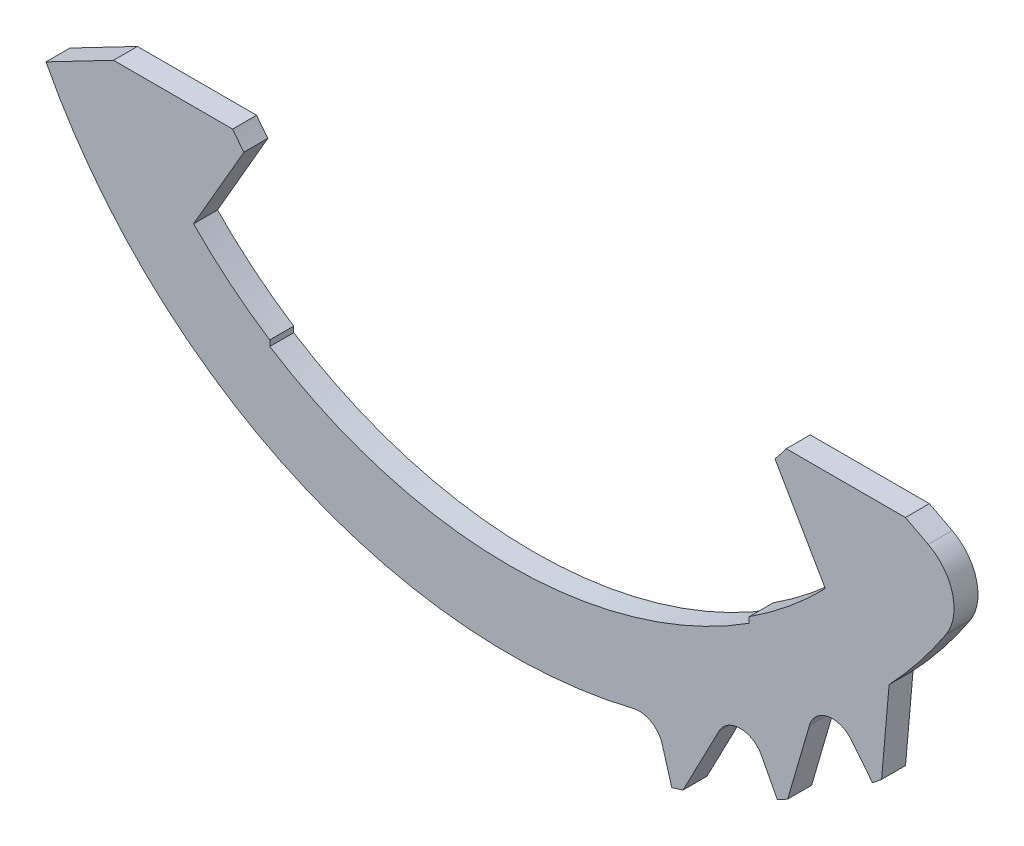
ISO-10303-21;
HEADER;
FILE_DESCRIPTION(('STEP AP214'),'2;1');
FILE_NAME('part.step','',(''),(''),'','','');
FILE_SCHEMA(('AUTOMOTIVE_DESIGN { 1 0 10303 214 1 1 1 1 }'));
ENDSEC;
DATA;
#1=APPLICATION_CONTEXT('core data for automotive mechanical design processes');
#2=APPLICATION_PROTOCOL_DEFINITION('international standard','automotive_design',2000,#1);
#3=PRODUCT_CONTEXT('',#1,'mechanical');
#4=PRODUCT('Part','Part','',(#3));
#5=PRODUCT_RELATED_PRODUCT_CATEGORY('part','',(#4));
#6=PRODUCT_DEFINITION_FORMATION('','',#4);
#7=PRODUCT_DEFINITION_CONTEXT('part definition',#1,'design');
#8=PRODUCT_DEFINITION('design','',#6,#7);
#9=PRODUCT_DEFINITION_SHAPE('','',#8);
#10=(LENGTH_UNIT() NAMED_UNIT(*) SI_UNIT(.MILLI.,.METRE.));
#11=(NAMED_UNIT(*) PLANE_ANGLE_UNIT() SI_UNIT($,.RADIAN.));
#12=(NAMED_UNIT(*) SI_UNIT($,.STERADIAN.) SOLID_ANGLE_UNIT());
#13=UNCERTAINTY_MEASURE_WITH_UNIT(LENGTH_MEASURE(1.E-05),#10,'distance_accuracy_value','');
#14=(GEOMETRIC_REPRESENTATION_CONTEXT(3) GLOBAL_UNCERTAINTY_ASSIGNED_CONTEXT((#13)) GLOBAL_UNIT_ASSIGNED_CONTEXT((#10,
#11,#12)) REPRESENTATION_CONTEXT('',''));
#15=CARTESIAN_POINT('',(0.,0.,0.));
#16=DIRECTION('',(0.,0.,1.));
#17=DIRECTION('',(1.,0.,0.));
#18=AXIS2_PLACEMENT_3D('',#15,#16,#17);
#19=CARTESIAN_POINT('',(2.70695605514835,-11.0739509171522,-0.00100000000000002));
#20=DIRECTION('',(0.,0.,1.));
#21=DIRECTION('',(1.,0.,0.));
#22=AXIS2_PLACEMENT_3D('',#19,#20,#21);
#23=CYLINDRICAL_SURFACE('',#22,0.5);
#24=DIRECTION('',(0.,0.,1.));
#25=VECTOR('',#24,1.);
#26=CARTESIAN_POINT('',(2.58822991237867,-10.5882513155227,-0.00100000000000002));
#27=LINE('',#26,#25);
#28=CARTESIAN_POINT('',(2.58822991237867,-10.5882513155227,0.));
#29=VERTEX_POINT('',#28);
#30=CARTESIAN_POINT('',(2.58822991237867,-10.5882513155227,0.5));
#31=VERTEX_POINT('',#30);
#32=EDGE_CURVE('E239',#29,#31,#27,.T.);
#33=ORIENTED_EDGE('',*,*,#32,.F.);
#34=CARTESIAN_POINT('',(2.70695605514835,-11.0739509171522,0.));
#35=DIRECTION('',(0.,0.,-1.));
#36=DIRECTION('',(-1.,0.,0.));
#37=AXIS2_PLACEMENT_3D('',#34,#35,#36);
#38=CIRCLE('',#37,0.5);
#39=CARTESIAN_POINT('',(3.18698098234131,-10.9340364101367,0.));
#40=VERTEX_POINT('',#39);
#41=EDGE_CURVE('E418',#40,#29,#38,.F.);
#42=ORIENTED_EDGE('',*,*,#41,.F.);
#43=DIRECTION('',(0.,0.,1.));
#44=VECTOR('',#43,1.);
#45=CARTESIAN_POINT('',(3.18698098234131,-10.9340364101367,-0.00100000000000002));
#46=LINE('',#45,#44);
#47=CARTESIAN_POINT('',(3.18698098234131,-10.9340364101367,0.5));
#48=VERTEX_POINT('',#47);
#49=EDGE_CURVE('E427',#40,#48,#46,.T.);
#50=ORIENTED_EDGE('',*,*,#49,.T.);
#51=CARTESIAN_POINT('',(2.70695605514835,-11.0739509171522,0.5));
#52=DIRECTION('',(0.,0.,1.));
#53=DIRECTION('',(0.382683432365087,0.923879532511288,0.));
#54=AXIS2_PLACEMENT_3D('',#51,#52,#53);
#55=CIRCLE('',#54,0.5);
#56=EDGE_CURVE('E424',#48,#31,#55,.T.);
#57=ORIENTED_EDGE('',*,*,#56,.T.);
#58=EDGE_LOOP('',(#33,#42,#50,#57));
#59=FACE_BOUND('',#58,.T.);
#60=ADVANCED_FACE('F50',(#59),#23,.F.);
#61=CARTESIAN_POINT('',(0.,0.,0.5));
#62=DIRECTION('',(0.,0.,-1.));
#63=DIRECTION('',(-1.,0.,0.));
#64=AXIS2_PLACEMENT_3D('',#61,#62,#63);
#65=CYLINDRICAL_SURFACE('',#64,12.1);
#66=CARTESIAN_POINT('',(0.,0.,0.));
#67=DIRECTION('',(0.,0.,1.));
#68=DIRECTION('',(1.,0.,0.));
#69=AXIS2_PLACEMENT_3D('',#66,#67,#68);
#70=CIRCLE('',#69,12.1);
#71=CARTESIAN_POINT('',(7.57367401342711,-9.43660224542387,0.));
#72=VERTEX_POINT('',#71);
#73=CARTESIAN_POINT('',(7.76317902804415,-9.28132810423893,0.));
#74=VERTEX_POINT('',#73);
#75=EDGE_CURVE('E295',#72,#74,#70,.T.);
#76=ORIENTED_EDGE('',*,*,#75,.T.);
#77=DIRECTION('',(0.,0.,1.));
#78=VECTOR('',#77,1.);
#79=CARTESIAN_POINT('',(7.76317902804415,-9.28132810423893,-0.00100000000000002));
#80=LINE('',#79,#78);
#81=CARTESIAN_POINT('',(7.76317902804415,-9.28132810423893,0.5));
#82=VERTEX_POINT('',#81);
#83=EDGE_CURVE('E363',#74,#82,#80,.T.);
#84=ORIENTED_EDGE('',*,*,#83,.T.);
#85=CARTESIAN_POINT('',(0.,0.,0.5));
#86=DIRECTION('',(0.,0.,1.));
#87=DIRECTION('',(1.,0.,0.));
#88=AXIS2_PLACEMENT_3D('',#85,#86,#87);
#89=CIRCLE('',#88,12.1);
#90=CARTESIAN_POINT('',(7.57367401342711,-9.43660224542387,0.5));
#91=VERTEX_POINT('',#90);
#92=EDGE_CURVE('E257',#91,#82,#89,.T.);
#93=ORIENTED_EDGE('',*,*,#92,.F.);
#94=DIRECTION('',(0.,0.,1.));
#95=VECTOR('',#94,1.);
#96=CARTESIAN_POINT('',(7.57367401342711,-9.43660224542387,-0.00100000000000002));
#97=LINE('',#96,#95);
#98=EDGE_CURVE('E380',#72,#91,#97,.T.);
#99=ORIENTED_EDGE('',*,*,#98,.F.);
#100=EDGE_LOOP('',(#76,#84,#93,#99));
#101=FACE_BOUND('',#100,.T.);
#102=ADVANCED_FACE('F468',(#101),#65,.T.);
#103=CARTESIAN_POINT('',(5.5871582201439,-10.7328310814565,0.));
#104=VERTEX_POINT('',#103);
#105=CARTESIAN_POINT('',(5.80331443124744,-10.6175110836804,0.));
#106=VERTEX_POINT('',#105);
#107=EDGE_CURVE('E298',#104,#106,#70,.T.);
#108=ORIENTED_EDGE('',*,*,#107,.T.);
#109=DIRECTION('',(0.,0.,1.));
#110=VECTOR('',#109,1.);
#111=CARTESIAN_POINT('',(5.80331443124744,-10.6175110836804,-0.00100000000000002));
#112=LINE('',#111,#110);
#113=CARTESIAN_POINT('',(5.80331443124744,-10.6175110836804,0.5));
#114=VERTEX_POINT('',#113);
#115=EDGE_CURVE('E381',#106,#114,#112,.T.);
#116=ORIENTED_EDGE('',*,*,#115,.T.);
#117=CARTESIAN_POINT('',(5.5871582201439,-10.7328310814565,0.5));
#118=VERTEX_POINT('',#117);
#119=EDGE_CURVE('E260',#118,#114,#89,.T.);
#120=ORIENTED_EDGE('',*,*,#119,.F.);
#121=DIRECTION('',(0.,0.,1.));
#122=VECTOR('',#121,1.);
#123=CARTESIAN_POINT('',(5.5871582201439,-10.7328310814565,-0.00100000000000002));
#124=LINE('',#123,#122);
#125=EDGE_CURVE('E406',#104,#118,#124,.T.);
#126=ORIENTED_EDGE('',*,*,#125,.F.);
#127=EDGE_LOOP('',(#108,#116,#120,#126));
#128=FACE_BOUND('',#127,.T.);
#129=ADVANCED_FACE('F485',(#128),#65,.T.);
#130=CARTESIAN_POINT('',(3.38593106977499,-11.6166032380697,0.));
#131=VERTEX_POINT('',#130);
#132=CARTESIAN_POINT('',(3.62043171539412,-11.5456690665448,0.));
#133=VERTEX_POINT('',#132);
#134=EDGE_CURVE('E299',#131,#133,#70,.T.);
#135=ORIENTED_EDGE('',*,*,#134,.T.);
#136=DIRECTION('',(0.,0.,1.));
#137=VECTOR('',#136,1.);
#138=CARTESIAN_POINT('',(3.62043171539412,-11.5456690665448,-0.00100000000000002));
#139=LINE('',#138,#137);
#140=CARTESIAN_POINT('',(3.62043171539412,-11.5456690665448,0.5));
#141=VERTEX_POINT('',#140);
#142=EDGE_CURVE('E407',#133,#141,#139,.T.);
#143=ORIENTED_EDGE('',*,*,#142,.T.);
#144=CARTESIAN_POINT('',(3.38593106977499,-11.6166032380697,0.5));
#145=VERTEX_POINT('',#144);
#146=EDGE_CURVE('E262',#145,#141,#89,.T.);
#147=ORIENTED_EDGE('',*,*,#146,.F.);
#148=DIRECTION('',(0.,0.,1.));
#149=VECTOR('',#148,1.);
#150=CARTESIAN_POINT('',(3.38593106977499,-11.6166032380697,-0.00100000000000002));
#151=LINE('',#150,#149);
#152=EDGE_CURVE('E426',#131,#145,#151,.T.);
#153=ORIENTED_EDGE('',*,*,#152,.F.);
#154=EDGE_LOOP('',(#135,#143,#147,#153));
#155=FACE_BOUND('',#154,.T.);
#156=ADVANCED_FACE('F491',(#155),#65,.T.);
#157=CARTESIAN_POINT('',(0.,0.,0.5));
#158=DIRECTION('',(0.,0.,-1.));
#159=DIRECTION('',(-1.,0.,0.));
#160=AXIS2_PLACEMENT_3D('',#157,#158,#159);
#161=CYLINDRICAL_SURFACE('',#160,7.2);
#162=CARTESIAN_POINT('',(0.,0.,0.));
#163=DIRECTION('',(0.,0.,-1.));
#164=DIRECTION('',(-1.,0.,0.));
#165=AXIS2_PLACEMENT_3D('',#162,#163,#164);
#166=CIRCLE('',#165,7.2);
#167=CARTESIAN_POINT('',(5.77494588719236,-4.3,0.));
#168=VERTEX_POINT('',#167);
#169=CARTESIAN_POINT('',(5.53923133011576,-4.5996647999027,0.));
#170=VERTEX_POINT('',#169);
#171=EDGE_CURVE('E272',#168,#170,#166,.T.);
#172=ORIENTED_EDGE('',*,*,#171,.T.);
#173=DIRECTION('',(0.,0.,-1.));
#174=VECTOR('',#173,1.);
#175=CARTESIAN_POINT('',(5.53923133011576,-4.5996647999027,0.5));
#176=LINE('',#175,#174);
#177=CARTESIAN_POINT('',(5.53923133011576,-4.5996647999027,0.5));
#178=VERTEX_POINT('',#177);
#179=EDGE_CURVE('E336',#178,#170,#176,.T.);
#180=ORIENTED_EDGE('',*,*,#179,.F.);
#181=CARTESIAN_POINT('',(0.,0.,0.5));
#182=DIRECTION('',(0.,0.,-1.));
#183=DIRECTION('',(-1.,0.,0.));
#184=AXIS2_PLACEMENT_3D('',#181,#182,#183);
#185=CIRCLE('',#184,7.2);
#186=CARTESIAN_POINT('',(5.77494588719236,-4.3,0.5));
#187=VERTEX_POINT('',#186);
#188=EDGE_CURVE('E304',#187,#178,#185,.T.);
#189=ORIENTED_EDGE('',*,*,#188,.F.);
#190=DIRECTION('',(0.,0.,-1.));
#191=VECTOR('',#190,1.);
#192=CARTESIAN_POINT('',(5.77494588719236,-4.3,0.5));
#193=LINE('',#192,#191);
#194=EDGE_CURVE('E271',#187,#168,#193,.T.);
#195=ORIENTED_EDGE('',*,*,#194,.T.);
#196=EDGE_LOOP('',(#172,#180,#189,#195));
#197=FACE_BOUND('',#196,.T.);
#198=ADVANCED_FACE('F570',(#197),#161,.F.);
#199=CARTESIAN_POINT('',(5.53923133011576,-4.5996647999027,0.5));
#200=DIRECTION('',(0.866025403784438,0.500000000000001,0.));
#201=DIRECTION('',(-0.500000000000001,0.866025403784438,0.));
#202=AXIS2_PLACEMENT_3D('',#199,#200,#201);
#203=PLANE('',#202);
#204=DIRECTION('',(0.500000000000001,-0.866025403784438,0.));
#205=VECTOR('',#204,1.);
#206=CARTESIAN_POINT('',(5.53923133011576,-4.5996647999027,0.));
#207=LINE('',#206,#205);
#208=CARTESIAN_POINT('',(6.59,-6.41964952314377,0.));
#209=VERTEX_POINT('',#208);
#210=EDGE_CURVE('E275',#170,#209,#207,.T.);
#211=ORIENTED_EDGE('',*,*,#210,.T.);
#212=DIRECTION('',(0.,0.,-1.));
#213=VECTOR('',#212,1.);
#214=CARTESIAN_POINT('',(6.59,-6.41964952314377,0.5));
#215=LINE('',#214,#213);
#216=CARTESIAN_POINT('',(6.59,-6.41964952314377,0.5));
#217=VERTEX_POINT('',#216);
#218=EDGE_CURVE('E333',#217,#209,#215,.T.);
#219=ORIENTED_EDGE('',*,*,#218,.F.);
#220=DIRECTION('',(0.500000000000001,-0.866025403784438,0.));
#221=VECTOR('',#220,1.);
#222=CARTESIAN_POINT('',(5.53923133011576,-4.5996647999027,0.5));
#223=LINE('',#222,#221);
#224=EDGE_CURVE('E434',#178,#217,#223,.T.);
#225=ORIENTED_EDGE('',*,*,#224,.F.);
#226=ORIENTED_EDGE('',*,*,#179,.T.);
#227=EDGE_LOOP('',(#211,#219,#225,#226));
#228=FACE_BOUND('',#227,.T.);
#229=ADVANCED_FACE('F567',(#228),#203,.F.);
#230=CARTESIAN_POINT('',(0.,0.,0.5));
#231=DIRECTION('',(0.,0.,-1.));
#232=DIRECTION('',(-1.,0.,0.));
#233=AXIS2_PLACEMENT_3D('',#230,#231,#232);
#234=CYLINDRICAL_SURFACE('',#233,9.2);
#235=CARTESIAN_POINT('',(0.,0.,0.));
#236=DIRECTION('',(0.,0.,-1.));
#237=DIRECTION('',(1.,0.,0.));
#238=AXIS2_PLACEMENT_3D('',#235,#236,#237);
#239=CIRCLE('',#238,9.2);
#240=CARTESIAN_POINT('',(5.,-7.72269383052313,0.));
#241=VERTEX_POINT('',#240);
#242=EDGE_CURVE('E278',#209,#241,#239,.T.);
#243=ORIENTED_EDGE('',*,*,#242,.T.);
#244=DIRECTION('',(0.,0.,-1.));
#245=VECTOR('',#244,1.);
#246=CARTESIAN_POINT('',(5.,-7.72269383052313,0.5));
#247=LINE('',#246,#245);
#248=CARTESIAN_POINT('',(5.,-7.72269383052313,0.5));
#249=VERTEX_POINT('',#248);
#250=EDGE_CURVE('E330',#249,#241,#247,.T.);
#251=ORIENTED_EDGE('',*,*,#250,.F.);
#252=CARTESIAN_POINT('',(0.,0.,0.5));
#253=DIRECTION('',(0.,0.,-1.));
#254=DIRECTION('',(1.,0.,0.));
#255=AXIS2_PLACEMENT_3D('',#252,#253,#254);
#256=CIRCLE('',#255,9.2);
#257=EDGE_CURVE('E436',#217,#249,#256,.T.);
#258=ORIENTED_EDGE('',*,*,#257,.F.);
#259=ORIENTED_EDGE('',*,*,#218,.T.);
#260=EDGE_LOOP('',(#243,#251,#258,#259));
#261=FACE_BOUND('',#260,.T.);
#262=ADVANCED_FACE('F563',(#261),#234,.F.);
#263=CARTESIAN_POINT('',(5.,-7.72269383052313,0.5));
#264=DIRECTION('',(1.,0.,0.));
#265=DIRECTION('',(0.,0.,-1.));
#266=AXIS2_PLACEMENT_3D('',#263,#264,#265);
#267=PLANE('',#266);
#268=DIRECTION('',(0.,-1.,0.));
#269=VECTOR('',#268,1.);
#270=CARTESIAN_POINT('',(5.,-7.72269383052313,0.));
#271=LINE('',#270,#269);
#272=CARTESIAN_POINT('',(4.99999999999999,-7.84155596804614,0.));
#273=VERTEX_POINT('',#272);
#274=EDGE_CURVE('E280',#241,#273,#271,.T.);
#275=ORIENTED_EDGE('',*,*,#274,.T.);
#276=DIRECTION('',(0.,0.,-1.));
#277=VECTOR('',#276,1.);
#278=CARTESIAN_POINT('',(4.99999999999999,-7.84155596804614,0.5));
#279=LINE('',#278,#277);
#280=CARTESIAN_POINT('',(4.99999999999999,-7.84155596804614,0.5));
#281=VERTEX_POINT('',#280);
#282=EDGE_CURVE('E327',#281,#273,#279,.T.);
#283=ORIENTED_EDGE('',*,*,#282,.F.);
#284=DIRECTION('',(0.,-1.,0.));
#285=VECTOR('',#284,1.);
#286=CARTESIAN_POINT('',(5.,-7.72269383052313,0.5));
#287=LINE('',#286,#285);
#288=EDGE_CURVE('E438',#249,#281,#287,.T.);
#289=ORIENTED_EDGE('',*,*,#288,.F.);
#290=ORIENTED_EDGE('',*,*,#250,.T.);
#291=EDGE_LOOP('',(#275,#283,#289,#290));
#292=FACE_BOUND('',#291,.T.);
#293=ADVANCED_FACE('F559',(#292),#267,.F.);
#294=CARTESIAN_POINT('',(0.,0.,0.5));
#295=DIRECTION('',(0.,0.,-1.));
#296=DIRECTION('',(-1.,0.,0.));
#297=AXIS2_PLACEMENT_3D('',#294,#295,#296);
#298=CYLINDRICAL_SURFACE('',#297,9.3);
#299=CARTESIAN_POINT('',(0.,0.,0.));
#300=DIRECTION('',(0.,0.,-1.));
#301=DIRECTION('',(1.,0.,0.));
#302=AXIS2_PLACEMENT_3D('',#299,#300,#301);
#303=CIRCLE('',#302,9.3);
#304=CARTESIAN_POINT('',(-5.,-7.84155596804614,0.));
#305=VERTEX_POINT('',#304);
#306=EDGE_CURVE('E282',#273,#305,#303,.T.);
#307=ORIENTED_EDGE('',*,*,#306,.T.);
#308=DIRECTION('',(0.,0.,-1.));
#309=VECTOR('',#308,1.);
#310=CARTESIAN_POINT('',(-5.,-7.84155596804614,0.5));
#311=LINE('',#310,#309);
#312=CARTESIAN_POINT('',(-5.,-7.84155596804614,0.5));
#313=VERTEX_POINT('',#312);
#314=EDGE_CURVE('E324',#313,#305,#311,.T.);
#315=ORIENTED_EDGE('',*,*,#314,.F.);
#316=CARTESIAN_POINT('',(0.,0.,0.5));
#317=DIRECTION('',(0.,0.,-1.));
#318=DIRECTION('',(1.,0.,0.));
#319=AXIS2_PLACEMENT_3D('',#316,#317,#318);
#320=CIRCLE('',#319,9.3);
#321=EDGE_CURVE('E440',#281,#313,#320,.T.);
#322=ORIENTED_EDGE('',*,*,#321,.F.);
#323=ORIENTED_EDGE('',*,*,#282,.T.);
#324=EDGE_LOOP('',(#307,#315,#322,#323));
#325=FACE_BOUND('',#324,.T.);
#326=ADVANCED_FACE('F555',(#325),#298,.F.);
#327=CARTESIAN_POINT('',(-5.,-7.72269383052313,0.5));
#328=DIRECTION('',(-1.,0.,0.));
#329=DIRECTION('',(0.,0.,1.));
#330=AXIS2_PLACEMENT_3D('',#327,#328,#329);
#331=PLANE('',#330);
#332=DIRECTION('',(0.,1.,0.));
#333=VECTOR('',#332,1.);
#334=CARTESIAN_POINT('',(-5.,-7.72269383052313,0.));
#335=LINE('',#334,#333);
#336=CARTESIAN_POINT('',(-5.00000000000001,-7.72269383052313,0.));
#337=VERTEX_POINT('',#336);
#338=EDGE_CURVE('E284',#305,#337,#335,.T.);
#339=ORIENTED_EDGE('',*,*,#338,.T.);
#340=DIRECTION('',(0.,0.,-1.));
#341=VECTOR('',#340,1.);
#342=CARTESIAN_POINT('',(-5.00000000000001,-7.72269383052313,0.5));
#343=LINE('',#342,#341);
#344=CARTESIAN_POINT('',(-5.00000000000001,-7.72269383052313,0.5));
#345=VERTEX_POINT('',#344);
#346=EDGE_CURVE('E321',#345,#337,#343,.T.);
#347=ORIENTED_EDGE('',*,*,#346,.F.);
#348=DIRECTION('',(0.,1.,0.));
#349=VECTOR('',#348,1.);
#350=CARTESIAN_POINT('',(-5.,-7.72269383052313,0.5));
#351=LINE('',#350,#349);
#352=EDGE_CURVE('E442',#313,#345,#351,.T.);
#353=ORIENTED_EDGE('',*,*,#352,.F.);
#354=ORIENTED_EDGE('',*,*,#314,.T.);
#355=EDGE_LOOP('',(#339,#347,#353,#354));
#356=FACE_BOUND('',#355,.T.);
#357=ADVANCED_FACE('F551',(#356),#331,.F.);
#358=CARTESIAN_POINT('',(0.,0.,0.5));
#359=DIRECTION('',(0.,0.,-1.));
#360=DIRECTION('',(-1.,0.,0.));
#361=AXIS2_PLACEMENT_3D('',#358,#359,#360);
#362=CYLINDRICAL_SURFACE('',#361,9.2);
#363=CARTESIAN_POINT('',(0.,0.,0.));
#364=DIRECTION('',(0.,0.,-1.));
#365=DIRECTION('',(1.,0.,0.));
#366=AXIS2_PLACEMENT_3D('',#363,#364,#365);
#367=CIRCLE('',#366,9.2);
#368=CARTESIAN_POINT('',(-6.59,-6.41964952314377,0.));
#369=VERTEX_POINT('',#368);
#370=EDGE_CURVE('E286',#337,#369,#367,.T.);
#371=ORIENTED_EDGE('',*,*,#370,.T.);
#372=DIRECTION('',(0.,0.,-1.));
#373=VECTOR('',#372,1.);
#374=CARTESIAN_POINT('',(-6.59,-6.41964952314377,0.5));
#375=LINE('',#374,#373);
#376=CARTESIAN_POINT('',(-6.59,-6.41964952314377,0.5));
#377=VERTEX_POINT('',#376);
#378=EDGE_CURVE('E318',#377,#369,#375,.T.);
#379=ORIENTED_EDGE('',*,*,#378,.F.);
#380=CARTESIAN_POINT('',(0.,0.,0.5));
#381=DIRECTION('',(0.,0.,-1.));
#382=DIRECTION('',(1.,0.,0.));
#383=AXIS2_PLACEMENT_3D('',#380,#381,#382);
#384=CIRCLE('',#383,9.2);
#385=EDGE_CURVE('E444',#345,#377,#384,.T.);
#386=ORIENTED_EDGE('',*,*,#385,.F.);
#387=ORIENTED_EDGE('',*,*,#346,.T.);
#388=EDGE_LOOP('',(#371,#379,#386,#387));
#389=FACE_BOUND('',#388,.T.);
#390=ADVANCED_FACE('F547',(#389),#362,.F.);
#391=CARTESIAN_POINT('',(-5.53923133011576,-4.5996647999027,0.5));
#392=DIRECTION('',(-0.866025403784438,0.500000000000001,0.));
#393=DIRECTION('',(-0.500000000000001,-0.866025403784438,0.));
#394=AXIS2_PLACEMENT_3D('',#391,#392,#393);
#395=PLANE('',#394);
#396=DIRECTION('',(0.500000000000001,0.866025403784438,0.));
#397=VECTOR('',#396,1.);
#398=CARTESIAN_POINT('',(-5.53923133011576,-4.5996647999027,0.));
#399=LINE('',#398,#397);
#400=CARTESIAN_POINT('',(-5.53923133011576,-4.5996647999027,0.));
#401=VERTEX_POINT('',#400);
#402=EDGE_CURVE('E288',#369,#401,#399,.T.);
#403=ORIENTED_EDGE('',*,*,#402,.T.);
#404=DIRECTION('',(0.,0.,-1.));
#405=VECTOR('',#404,1.);
#406=CARTESIAN_POINT('',(-5.53923133011576,-4.5996647999027,0.5));
#407=LINE('',#406,#405);
#408=CARTESIAN_POINT('',(-5.53923133011576,-4.5996647999027,0.5));
#409=VERTEX_POINT('',#408);
#410=EDGE_CURVE('E315',#409,#401,#407,.T.);
#411=ORIENTED_EDGE('',*,*,#410,.F.);
#412=DIRECTION('',(0.500000000000001,0.866025403784438,0.));
#413=VECTOR('',#412,1.);
#414=CARTESIAN_POINT('',(-5.53923133011576,-4.5996647999027,0.5));
#415=LINE('',#414,#413);
#416=EDGE_CURVE('E446',#377,#409,#415,.T.);
#417=ORIENTED_EDGE('',*,*,#416,.F.);
#418=ORIENTED_EDGE('',*,*,#378,.T.);
#419=EDGE_LOOP('',(#403,#411,#417,#418));
#420=FACE_BOUND('',#419,.T.);
#421=ADVANCED_FACE('F544',(#420),#395,.F.);
#422=CARTESIAN_POINT('',(0.,0.,0.5));
#423=DIRECTION('',(0.,0.,-1.));
#424=DIRECTION('',(-1.,0.,0.));
#425=AXIS2_PLACEMENT_3D('',#422,#423,#424);
#426=CYLINDRICAL_SURFACE('',#425,7.2);
#427=CARTESIAN_POINT('',(0.,0.,0.));
#428=DIRECTION('',(0.,0.,-1.));
#429=DIRECTION('',(1.,0.,0.));
#430=AXIS2_PLACEMENT_3D('',#427,#428,#429);
#431=CIRCLE('',#430,7.2);
#432=CARTESIAN_POINT('',(-5.77494588719236,-4.3,0.));
#433=VERTEX_POINT('',#432);
#434=EDGE_CURVE('E290',#401,#433,#431,.T.);
#435=ORIENTED_EDGE('',*,*,#434,.T.);
#436=DIRECTION('',(0.,0.,-1.));
#437=VECTOR('',#436,1.);
#438=CARTESIAN_POINT('',(-5.77494588719236,-4.3,0.5));
#439=LINE('',#438,#437);
#440=CARTESIAN_POINT('',(-5.77494588719236,-4.3,0.5));
#441=VERTEX_POINT('',#440);
#442=EDGE_CURVE('E312',#441,#433,#439,.T.);
#443=ORIENTED_EDGE('',*,*,#442,.F.);
#444=CARTESIAN_POINT('',(0.,0.,0.5));
#445=DIRECTION('',(0.,0.,-1.));
#446=DIRECTION('',(1.,0.,0.));
#447=AXIS2_PLACEMENT_3D('',#444,#445,#446);
#448=CIRCLE('',#447,7.2);
#449=EDGE_CURVE('E263',#409,#441,#448,.T.);
#450=ORIENTED_EDGE('',*,*,#449,.F.);
#451=ORIENTED_EDGE('',*,*,#410,.T.);
#452=EDGE_LOOP('',(#435,#443,#450,#451));
#453=FACE_BOUND('',#452,.T.);
#454=ADVANCED_FACE('F452',(#453),#426,.F.);
#455=CARTESIAN_POINT('',(-8.26022314597606,-4.3,0.5));
#456=DIRECTION('',(0.,-1.,0.));
#457=DIRECTION('',(1.,0.,0.));
#458=AXIS2_PLACEMENT_3D('',#455,#456,#457);
#459=PLANE('',#458);
#460=DIRECTION('',(-1.,0.,0.));
#461=VECTOR('',#460,1.);
#462=CARTESIAN_POINT('',(-8.26022314597606,-4.3,0.));
#463=LINE('',#462,#461);
#464=CARTESIAN_POINT('',(-8.26022314597606,-4.3,0.));
#465=VERTEX_POINT('',#464);
#466=EDGE_CURVE('E292',#433,#465,#463,.T.);
#467=ORIENTED_EDGE('',*,*,#466,.T.);
#468=DIRECTION('',(0.,0.,-1.));
#469=VECTOR('',#468,1.);
#470=CARTESIAN_POINT('',(-8.26022314597606,-4.3,0.5));
#471=LINE('',#470,#469);
#472=CARTESIAN_POINT('',(-8.26022314597606,-4.3,0.5));
#473=VERTEX_POINT('',#472);
#474=EDGE_CURVE('E310',#473,#465,#471,.T.);
#475=ORIENTED_EDGE('',*,*,#474,.F.);
#476=DIRECTION('',(-1.,0.,0.));
#477=VECTOR('',#476,1.);
#478=CARTESIAN_POINT('',(-8.26022314597606,-4.3,0.5));
#479=LINE('',#478,#477);
#480=EDGE_CURVE('E255',#441,#473,#479,.T.);
#481=ORIENTED_EDGE('',*,*,#480,.F.);
#482=ORIENTED_EDGE('',*,*,#442,.T.);
#483=EDGE_LOOP('',(#467,#475,#481,#482));
#484=FACE_BOUND('',#483,.T.);
#485=ADVANCED_FACE('F456',(#484),#459,.F.);
#486=CARTESIAN_POINT('',(-8.26022314597606,-4.3,0.5));
#487=DIRECTION('',(0.461748613235031,-0.887010833178223,0.));
#488=DIRECTION('',(0.887010833178223,0.461748613235031,0.));
#489=AXIS2_PLACEMENT_3D('',#486,#487,#488);
#490=PLANE('',#489);
#491=DIRECTION('',(-0.887010833178223,-0.461748613235031,0.));
#492=VECTOR('',#491,1.);
#493=CARTESIAN_POINT('',(-8.26022314597606,-4.3,0.));
#494=LINE('',#493,#492);
#495=CARTESIAN_POINT('',(-9.66841808164263,-5.03305988426184,0.));
#496=VERTEX_POINT('',#495);
#497=EDGE_CURVE('E251',#465,#496,#494,.T.);
#498=ORIENTED_EDGE('',*,*,#497,.T.);
#499=DIRECTION('',(0.,0.,1.));
#500=VECTOR('',#499,1.);
#501=CARTESIAN_POINT('',(-9.66841808164263,-5.03305988426184,-0.00100000000000002));
#502=LINE('',#501,#500);
#503=CARTESIAN_POINT('',(-9.66841808164263,-5.03305988426184,0.5));
#504=VERTEX_POINT('',#503);
#505=EDGE_CURVE('E236',#496,#504,#502,.T.);
#506=ORIENTED_EDGE('',*,*,#505,.T.);
#507=DIRECTION('',(-0.887010833178223,-0.461748613235031,0.));
#508=VECTOR('',#507,1.);
#509=CARTESIAN_POINT('',(-8.26022314597606,-4.3,0.5));
#510=LINE('',#509,#508);
#511=EDGE_CURVE('E249',#473,#504,#510,.T.);
#512=ORIENTED_EDGE('',*,*,#511,.F.);
#513=ORIENTED_EDGE('',*,*,#474,.T.);
#514=EDGE_LOOP('',(#498,#506,#512,#513));
#515=FACE_BOUND('',#514,.T.);
#516=ADVANCED_FACE('F247',(#515),#490,.F.);
#517=CARTESIAN_POINT('',(8.26022314597606,-4.3,0.5));
#518=DIRECTION('',(-0.461748613235032,-0.887010833178223,0.));
#519=DIRECTION('',(0.887010833178223,-0.461748613235032,0.));
#520=AXIS2_PLACEMENT_3D('',#517,#518,#519);
#521=PLANE('',#520);
#522=DIRECTION('',(-0.887010833178223,0.461748613235032,0.));
#523=VECTOR('',#522,1.);
#524=CARTESIAN_POINT('',(8.26022314597606,-4.3,0.5));
#525=LINE('',#524,#523);
#526=CARTESIAN_POINT('',(8.73649386454358,-4.54793084322885,0.5));
#527=VERTEX_POINT('',#526);
#528=CARTESIAN_POINT('',(8.26022314597606,-4.3,0.5));
#529=VERTEX_POINT('',#528);
#530=EDGE_CURVE('E267',#527,#529,#525,.T.);
#531=ORIENTED_EDGE('',*,*,#530,.F.);
#532=DIRECTION('',(0.,0.,1.));
#533=VECTOR('',#532,1.);
#534=CARTESIAN_POINT('',(8.73649386454358,-4.54793084322885,0.5));
#535=LINE('',#534,#533);
#536=CARTESIAN_POINT('',(8.73649386454358,-4.54793084322885,0.));
#537=VERTEX_POINT('',#536);
#538=EDGE_CURVE('E58',#527,#537,#535,.F.);
#539=ORIENTED_EDGE('',*,*,#538,.T.);
#540=DIRECTION('',(-0.887010833178223,0.461748613235032,0.));
#541=VECTOR('',#540,1.);
#542=CARTESIAN_POINT('',(8.26022314597606,-4.3,0.));
#543=LINE('',#542,#541);
#544=CARTESIAN_POINT('',(8.26022314597606,-4.3,0.));
#545=VERTEX_POINT('',#544);
#546=EDGE_CURVE('E300',#537,#545,#543,.T.);
#547=ORIENTED_EDGE('',*,*,#546,.T.);
#548=DIRECTION('',(0.,0.,-1.));
#549=VECTOR('',#548,1.);
#550=CARTESIAN_POINT('',(8.26022314597606,-4.3,0.5));
#551=LINE('',#550,#549);
#552=EDGE_CURVE('E307',#529,#545,#551,.T.);
#553=ORIENTED_EDGE('',*,*,#552,.F.);
#554=EDGE_LOOP('',(#531,#539,#547,#553));
#555=FACE_BOUND('',#554,.T.);
#556=ADVANCED_FACE('F534',(#555),#521,.F.);
#557=CARTESIAN_POINT('',(5.77494588719236,-4.3,0.5));
#558=DIRECTION('',(0.,-1.,0.));
#559=DIRECTION('',(1.,0.,0.));
#560=AXIS2_PLACEMENT_3D('',#557,#558,#559);
#561=PLANE('',#560);
#562=DIRECTION('',(-1.,0.,0.));
#563=VECTOR('',#562,1.);
#564=CARTESIAN_POINT('',(5.77494588719236,-4.3,0.));
#565=LINE('',#564,#563);
#566=EDGE_CURVE('E302',#545,#168,#565,.T.);
#567=ORIENTED_EDGE('',*,*,#566,.T.);
#568=ORIENTED_EDGE('',*,*,#194,.F.);
#569=DIRECTION('',(-1.,0.,0.));
#570=VECTOR('',#569,1.);
#571=CARTESIAN_POINT('',(5.77494588719236,-4.3,0.5));
#572=LINE('',#571,#570);
#573=EDGE_CURVE('E269',#529,#187,#572,.T.);
#574=ORIENTED_EDGE('',*,*,#573,.F.);
#575=ORIENTED_EDGE('',*,*,#552,.T.);
#576=EDGE_LOOP('',(#567,#568,#574,#575));
#577=FACE_BOUND('',#576,.T.);
#578=ADVANCED_FACE('F529',(#577),#561,.F.);
#579=CARTESIAN_POINT('',(0.,0.,0.5));
#580=DIRECTION('',(0.,0.,-1.));
#581=DIRECTION('',(-1.,0.,0.));
#582=AXIS2_PLACEMENT_3D('',#579,#580,#581);
#583=PLANE('',#582);
#584=ORIENTED_EDGE('',*,*,#511,.T.);
#585=CARTESIAN_POINT('',(0.,0.,0.5));
#586=DIRECTION('',(0.,0.,-1.));
#587=DIRECTION('',(1.,0.,0.));
#588=AXIS2_PLACEMENT_3D('',#585,#586,#587);
#589=CIRCLE('',#588,10.9);
#590=EDGE_CURVE('E233',#31,#504,#589,.T.);
#591=ORIENTED_EDGE('',*,*,#590,.F.);
#592=ORIENTED_EDGE('',*,*,#56,.F.);
#593=DIRECTION('',(-0.27982901403099,0.960049854385929,0.));
#594=VECTOR('',#593,1.);
#595=CARTESIAN_POINT('',(3.18698098234131,-10.9340364101367,0.5));
#596=LINE('',#595,#594);
#597=EDGE_CURVE('E421',#145,#48,#596,.T.);
#598=ORIENTED_EDGE('',*,*,#597,.F.);
#599=ORIENTED_EDGE('',*,*,#146,.T.);
#600=DIRECTION('',(-0.461748613235031,-0.887010833178223,0.));
#601=VECTOR('',#600,1.);
#602=CARTESIAN_POINT('',(3.62043171539412,-11.5456690665448,0.5));
#603=LINE('',#602,#601);
#604=CARTESIAN_POINT('',(4.37185788741681,-10.1021928203508,0.5));
#605=VERTEX_POINT('',#604);
#606=EDGE_CURVE('E404',#605,#141,#603,.T.);
#607=ORIENTED_EDGE('',*,*,#606,.F.);
#608=CARTESIAN_POINT('',(4.81536330400592,-10.3330671269683,0.5));
#609=DIRECTION('',(0.,0.,1.));
#610=DIRECTION('',(0.195090322016125,0.980785280403231,0.));
#611=AXIS2_PLACEMENT_3D('',#608,#609,#610);
#612=CIRCLE('',#611,0.5);
#613=CARTESIAN_POINT('',(5.25886872059503,-10.1021928203508,0.5));
#614=VERTEX_POINT('',#613);
#615=EDGE_CURVE('E401',#614,#605,#612,.T.);
#616=ORIENTED_EDGE('',*,*,#615,.F.);
#617=DIRECTION('',(-0.461748613235033,0.887010833178222,0.));
#618=VECTOR('',#617,1.);
#619=CARTESIAN_POINT('',(5.25886872059503,-10.1021928203508,0.5));
#620=LINE('',#619,#618);
#621=EDGE_CURVE('E398',#118,#614,#620,.T.);
#622=ORIENTED_EDGE('',*,*,#621,.F.);
#623=ORIENTED_EDGE('',*,*,#119,.T.);
#624=DIRECTION('',(-0.279829014030988,-0.96004985438593,0.));
#625=VECTOR('',#624,1.);
#626=CARTESIAN_POINT('',(5.80331443124744,-10.6175110836804,0.5));
#627=LINE('',#626,#625);
#628=CARTESIAN_POINT('',(6.25869391438443,-9.05517485493036,0.5));
#629=VERTEX_POINT('',#628);
#630=EDGE_CURVE('E378',#629,#114,#627,.T.);
#631=ORIENTED_EDGE('',*,*,#630,.F.);
#632=CARTESIAN_POINT('',(6.73871884157739,-9.19508936194586,0.5));
#633=DIRECTION('',(0.,0.,1.));
#634=DIRECTION('',(0.,1.,0.));
#635=AXIS2_PLACEMENT_3D('',#632,#633,#634);
#636=CIRCLE('',#635,0.5);
#637=CARTESIAN_POINT('',(7.12866108312383,-8.88212762585383,0.5));
#638=VERTEX_POINT('',#637);
#639=EDGE_CURVE('E375',#638,#629,#636,.T.);
#640=ORIENTED_EDGE('',*,*,#639,.F.);
#641=DIRECTION('',(-0.625923472184058,0.779884483092882,0.));
#642=VECTOR('',#641,1.);
#643=CARTESIAN_POINT('',(7.12866108312383,-8.88212762585383,0.5));
#644=LINE('',#643,#642);
#645=EDGE_CURVE('E372',#91,#638,#644,.T.);
#646=ORIENTED_EDGE('',*,*,#645,.F.);
#647=ORIENTED_EDGE('',*,*,#92,.T.);
#648=DIRECTION('',(-0.0871557427476539,-0.996194698091746,0.));
#649=VECTOR('',#648,1.);
#650=CARTESIAN_POINT('',(7.76317902804415,-9.28132810423893,0.5));
#651=LINE('',#650,#649);
#652=CARTESIAN_POINT('',(7.91999592597633,-7.48890275891724,0.5));
#653=VERTEX_POINT('',#652);
#654=EDGE_CURVE('E352',#653,#82,#651,.T.);
#655=ORIENTED_EDGE('',*,*,#654,.F.);
#656=CARTESIAN_POINT('',(0.,0.,0.5));
#657=DIRECTION('',(0.,0.,-1.));
#658=DIRECTION('',(-1.,0.,0.));
#659=AXIS2_PLACEMENT_3D('',#656,#657,#658);
#660=CIRCLE('',#659,10.9);
#661=CARTESIAN_POINT('',(9.11057810497609,-5.98392568412496,0.5));
#662=VERTEX_POINT('',#661);
#663=EDGE_CURVE('E347',#662,#653,#660,.T.);
#664=ORIENTED_EDGE('',*,*,#663,.F.);
#665=CARTESIAN_POINT('',(8.27474525130855,-5.43494167640707,0.5));
#666=DIRECTION('',(0.,0.,-1.));
#667=DIRECTION('',(-1.,0.,0.));
#668=AXIS2_PLACEMENT_3D('',#665,#666,#667);
#669=CIRCLE('',#668,1.);
#670=EDGE_CURVE('E72',#662,#527,#669,.F.);
#671=ORIENTED_EDGE('',*,*,#670,.T.);
#672=ORIENTED_EDGE('',*,*,#530,.T.);
#673=ORIENTED_EDGE('',*,*,#573,.T.);
#674=ORIENTED_EDGE('',*,*,#188,.T.);
#675=ORIENTED_EDGE('',*,*,#224,.T.);
#676=ORIENTED_EDGE('',*,*,#257,.T.);
#677=ORIENTED_EDGE('',*,*,#288,.T.);
#678=ORIENTED_EDGE('',*,*,#321,.T.);
#679=ORIENTED_EDGE('',*,*,#352,.T.);
#680=ORIENTED_EDGE('',*,*,#385,.T.);
#681=ORIENTED_EDGE('',*,*,#416,.T.);
#682=ORIENTED_EDGE('',*,*,#449,.T.);
#683=ORIENTED_EDGE('',*,*,#480,.T.);
#684=EDGE_LOOP('',(#584,#591,#592,#598,#599,#607,#616,#622,#623,#631,#640,#646,#647,#655,#664,
#671,#672,#673,#674,#675,#676,#677,#678,#679,#680,#681,#682,#683));
#685=FACE_BOUND('',#684,.T.);
#686=ADVANCED_FACE('F253',(#685),#583,.F.);
#687=CARTESIAN_POINT('',(0.,0.,0.));
#688=DIRECTION('',(0.,0.,-1.));
#689=DIRECTION('',(-1.,0.,0.));
#690=AXIS2_PLACEMENT_3D('',#687,#688,#689);
#691=PLANE('',#690);
#692=CARTESIAN_POINT('',(0.,0.,0.));
#693=DIRECTION('',(0.,0.,-1.));
#694=DIRECTION('',(-1.,0.,0.));
#695=AXIS2_PLACEMENT_3D('',#692,#693,#694);
#696=CIRCLE('',#695,10.9);
#697=EDGE_CURVE('E243',#29,#496,#696,.T.);
#698=ORIENTED_EDGE('',*,*,#697,.T.);
#699=ORIENTED_EDGE('',*,*,#497,.F.);
#700=ORIENTED_EDGE('',*,*,#466,.F.);
#701=ORIENTED_EDGE('',*,*,#434,.F.);
#702=ORIENTED_EDGE('',*,*,#402,.F.);
#703=ORIENTED_EDGE('',*,*,#370,.F.);
#704=ORIENTED_EDGE('',*,*,#338,.F.);
#705=ORIENTED_EDGE('',*,*,#306,.F.);
#706=ORIENTED_EDGE('',*,*,#274,.F.);
#707=ORIENTED_EDGE('',*,*,#242,.F.);
#708=ORIENTED_EDGE('',*,*,#210,.F.);
#709=ORIENTED_EDGE('',*,*,#171,.F.);
#710=ORIENTED_EDGE('',*,*,#566,.F.);
#711=ORIENTED_EDGE('',*,*,#546,.F.);
#712=CARTESIAN_POINT('',(8.27474525130855,-5.43494167640707,0.));
#713=DIRECTION('',(0.,0.,-1.));
#714=DIRECTION('',(-1.,0.,0.));
#715=AXIS2_PLACEMENT_3D('',#712,#713,#714);
#716=CIRCLE('',#715,1.);
#717=CARTESIAN_POINT('',(9.11057810497609,-5.98392568412496,0.));
#718=VERTEX_POINT('',#717);
#719=EDGE_CURVE('E12',#537,#718,#716,.T.);
#720=ORIENTED_EDGE('',*,*,#719,.T.);
#721=CARTESIAN_POINT('',(0.,0.,0.));
#722=DIRECTION('',(0.,0.,-1.));
#723=DIRECTION('',(-1.,0.,0.));
#724=AXIS2_PLACEMENT_3D('',#721,#722,#723);
#725=CIRCLE('',#724,10.9);
#726=CARTESIAN_POINT('',(7.91999592597633,-7.48890275891724,0.));
#727=VERTEX_POINT('',#726);
#728=EDGE_CURVE('E349',#718,#727,#725,.T.);
#729=ORIENTED_EDGE('',*,*,#728,.T.);
#730=DIRECTION('',(-0.0871557427476539,-0.996194698091746,0.));
#731=VECTOR('',#730,1.);
#732=CARTESIAN_POINT('',(7.76317902804415,-9.28132810423893,0.));
#733=LINE('',#732,#731);
#734=EDGE_CURVE('E354',#727,#74,#733,.T.);
#735=ORIENTED_EDGE('',*,*,#734,.T.);
#736=ORIENTED_EDGE('',*,*,#75,.F.);
#737=DIRECTION('',(-0.625923472184058,0.779884483092882,0.));
#738=VECTOR('',#737,1.);
#739=CARTESIAN_POINT('',(7.12866108312383,-8.88212762585383,0.));
#740=LINE('',#739,#738);
#741=CARTESIAN_POINT('',(7.12866108312383,-8.88212762585383,0.));
#742=VERTEX_POINT('',#741);
#743=EDGE_CURVE('E384',#72,#742,#740,.T.);
#744=ORIENTED_EDGE('',*,*,#743,.T.);
#745=CARTESIAN_POINT('',(6.73871884157739,-9.19508936194586,0.));
#746=DIRECTION('',(0.,0.,-1.));
#747=DIRECTION('',(-1.,0.,0.));
#748=AXIS2_PLACEMENT_3D('',#745,#746,#747);
#749=CIRCLE('',#748,0.5);
#750=CARTESIAN_POINT('',(6.25869391438443,-9.05517485493036,0.));
#751=VERTEX_POINT('',#750);
#752=EDGE_CURVE('E366',#742,#751,#749,.F.);
#753=ORIENTED_EDGE('',*,*,#752,.T.);
#754=DIRECTION('',(-0.279829014030988,-0.96004985438593,0.));
#755=VECTOR('',#754,1.);
#756=CARTESIAN_POINT('',(5.80331443124744,-10.6175110836804,0.));
#757=LINE('',#756,#755);
#758=EDGE_CURVE('E369',#751,#106,#757,.T.);
#759=ORIENTED_EDGE('',*,*,#758,.T.);
#760=ORIENTED_EDGE('',*,*,#107,.F.);
#761=DIRECTION('',(-0.461748613235033,0.887010833178222,0.));
#762=VECTOR('',#761,1.);
#763=CARTESIAN_POINT('',(5.25886872059503,-10.1021928203508,0.));
#764=LINE('',#763,#762);
#765=CARTESIAN_POINT('',(5.25886872059503,-10.1021928203508,0.));
#766=VERTEX_POINT('',#765);
#767=EDGE_CURVE('E410',#104,#766,#764,.T.);
#768=ORIENTED_EDGE('',*,*,#767,.T.);
#769=CARTESIAN_POINT('',(4.81536330400592,-10.3330671269683,0.));
#770=DIRECTION('',(0.,0.,-1.));
#771=DIRECTION('',(-1.,0.,0.));
#772=AXIS2_PLACEMENT_3D('',#769,#770,#771);
#773=CIRCLE('',#772,0.5);
#774=CARTESIAN_POINT('',(4.37185788741681,-10.1021928203508,0.));
#775=VERTEX_POINT('',#774);
#776=EDGE_CURVE('E392',#766,#775,#773,.F.);
#777=ORIENTED_EDGE('',*,*,#776,.T.);
#778=DIRECTION('',(-0.461748613235031,-0.887010833178223,0.));
#779=VECTOR('',#778,1.);
#780=CARTESIAN_POINT('',(3.62043171539412,-11.5456690665448,0.));
#781=LINE('',#780,#779);
#782=EDGE_CURVE('E395',#775,#133,#781,.T.);
#783=ORIENTED_EDGE('',*,*,#782,.T.);
#784=ORIENTED_EDGE('',*,*,#134,.F.);
#785=DIRECTION('',(-0.27982901403099,0.960049854385929,0.));
#786=VECTOR('',#785,1.);
#787=CARTESIAN_POINT('',(3.18698098234131,-10.9340364101367,0.));
#788=LINE('',#787,#786);
#789=EDGE_CURVE('E276',#131,#40,#788,.T.);
#790=ORIENTED_EDGE('',*,*,#789,.T.);
#791=ORIENTED_EDGE('',*,*,#41,.T.);
#792=EDGE_LOOP('',(#698,#699,#700,#701,#702,#703,#704,#705,#706,#707,#708,#709,#710,#711,#720,
#729,#735,#736,#744,#753,#759,#760,#768,#777,#783,#784,#790,#791));
#793=FACE_BOUND('',#792,.T.);
#794=ADVANCED_FACE('F458',(#793),#691,.T.);
#795=CARTESIAN_POINT('',(3.18698098234131,-10.9340364101367,-0.00100000000000002));
#796=DIRECTION('',(0.960049854385929,0.27982901403099,0.));
#797=DIRECTION('',(-0.27982901403099,0.960049854385929,0.));
#798=AXIS2_PLACEMENT_3D('',#795,#796,#797);
#799=PLANE('',#798);
#800=ORIENTED_EDGE('',*,*,#152,.T.);
#801=ORIENTED_EDGE('',*,*,#597,.T.);
#802=ORIENTED_EDGE('',*,*,#49,.F.);
#803=ORIENTED_EDGE('',*,*,#789,.F.);
#804=EDGE_LOOP('',(#800,#801,#802,#803));
#805=FACE_BOUND('',#804,.T.);
#806=ADVANCED_FACE('F523',(#805),#799,.F.);
#807=CARTESIAN_POINT('',(3.62043171539412,-11.5456690665448,-0.00100000000000002));
#808=DIRECTION('',(-0.887010833178223,0.461748613235031,0.));
#809=DIRECTION('',(-0.461748613235031,-0.887010833178223,0.));
#810=AXIS2_PLACEMENT_3D('',#807,#808,#809);
#811=PLANE('',#810);
#812=DIRECTION('',(0.,0.,1.));
#813=VECTOR('',#812,1.);
#814=CARTESIAN_POINT('',(4.37185788741681,-10.1021928203508,-0.00100000000000002));
#815=LINE('',#814,#813);
#816=EDGE_CURVE('E411',#775,#605,#815,.T.);
#817=ORIENTED_EDGE('',*,*,#816,.T.);
#818=ORIENTED_EDGE('',*,*,#606,.T.);
#819=ORIENTED_EDGE('',*,*,#142,.F.);
#820=ORIENTED_EDGE('',*,*,#782,.F.);
#821=EDGE_LOOP('',(#817,#818,#819,#820));
#822=FACE_BOUND('',#821,.T.);
#823=ADVANCED_FACE('F497',(#822),#811,.F.);
#824=CARTESIAN_POINT('',(4.81536330400592,-10.3330671269683,-0.00100000000000002));
#825=DIRECTION('',(0.,0.,1.));
#826=DIRECTION('',(1.,0.,0.));
#827=AXIS2_PLACEMENT_3D('',#824,#825,#826);
#828=CYLINDRICAL_SURFACE('',#827,0.5);
#829=DIRECTION('',(0.,0.,1.));
#830=VECTOR('',#829,1.);
#831=CARTESIAN_POINT('',(5.25886872059503,-10.1021928203508,-0.00100000000000002));
#832=LINE('',#831,#830);
#833=EDGE_CURVE('E413',#766,#614,#832,.T.);
#834=ORIENTED_EDGE('',*,*,#833,.T.);
#835=ORIENTED_EDGE('',*,*,#615,.T.);
#836=ORIENTED_EDGE('',*,*,#816,.F.);
#837=ORIENTED_EDGE('',*,*,#776,.F.);
#838=EDGE_LOOP('',(#834,#835,#836,#837));
#839=FACE_BOUND('',#838,.T.);
#840=ADVANCED_FACE('F499',(#839),#828,.F.);
#841=CARTESIAN_POINT('',(5.25886872059503,-10.1021928203508,-0.00100000000000002));
#842=DIRECTION('',(0.887010833178222,0.461748613235033,0.));
#843=DIRECTION('',(-0.461748613235033,0.887010833178222,0.));
#844=AXIS2_PLACEMENT_3D('',#841,#842,#843);
#845=PLANE('',#844);
#846=ORIENTED_EDGE('',*,*,#125,.T.);
#847=ORIENTED_EDGE('',*,*,#621,.T.);
#848=ORIENTED_EDGE('',*,*,#833,.F.);
#849=ORIENTED_EDGE('',*,*,#767,.F.);
#850=EDGE_LOOP('',(#846,#847,#848,#849));
#851=FACE_BOUND('',#850,.T.);
#852=ADVANCED_FACE('F505',(#851),#845,.F.);
#853=CARTESIAN_POINT('',(5.80331443124744,-10.6175110836804,-0.00100000000000002));
#854=DIRECTION('',(-0.96004985438593,0.279829014030988,0.));
#855=DIRECTION('',(-0.279829014030988,-0.96004985438593,0.));
#856=AXIS2_PLACEMENT_3D('',#853,#854,#855);
#857=PLANE('',#856);
#858=DIRECTION('',(0.,0.,1.));
#859=VECTOR('',#858,1.);
#860=CARTESIAN_POINT('',(6.25869391438443,-9.05517485493036,-0.00100000000000002));
#861=LINE('',#860,#859);
#862=EDGE_CURVE('E385',#751,#629,#861,.T.);
#863=ORIENTED_EDGE('',*,*,#862,.T.);
#864=ORIENTED_EDGE('',*,*,#630,.T.);
#865=ORIENTED_EDGE('',*,*,#115,.F.);
#866=ORIENTED_EDGE('',*,*,#758,.F.);
#867=EDGE_LOOP('',(#863,#864,#865,#866));
#868=FACE_BOUND('',#867,.T.);
#869=ADVANCED_FACE('F507',(#868),#857,.F.);
#870=CARTESIAN_POINT('',(6.73871884157739,-9.19508936194586,-0.00100000000000002));
#871=DIRECTION('',(0.,0.,1.));
#872=DIRECTION('',(1.,0.,0.));
#873=AXIS2_PLACEMENT_3D('',#870,#871,#872);
#874=CYLINDRICAL_SURFACE('',#873,0.5);
#875=DIRECTION('',(0.,0.,1.));
#876=VECTOR('',#875,1.);
#877=CARTESIAN_POINT('',(7.12866108312383,-8.88212762585383,-0.00100000000000002));
#878=LINE('',#877,#876);
#879=EDGE_CURVE('E387',#742,#638,#878,.T.);
#880=ORIENTED_EDGE('',*,*,#879,.T.);
#881=ORIENTED_EDGE('',*,*,#639,.T.);
#882=ORIENTED_EDGE('',*,*,#862,.F.);
#883=ORIENTED_EDGE('',*,*,#752,.F.);
#884=EDGE_LOOP('',(#880,#881,#882,#883));
#885=FACE_BOUND('',#884,.T.);
#886=ADVANCED_FACE('F478',(#885),#874,.F.);
#887=CARTESIAN_POINT('',(7.12866108312383,-8.88212762585383,-0.00100000000000002));
#888=DIRECTION('',(0.779884483092882,0.625923472184058,0.));
#889=DIRECTION('',(-0.625923472184058,0.779884483092882,0.));
#890=AXIS2_PLACEMENT_3D('',#887,#888,#889);
#891=PLANE('',#890);
#892=ORIENTED_EDGE('',*,*,#98,.T.);
#893=ORIENTED_EDGE('',*,*,#645,.T.);
#894=ORIENTED_EDGE('',*,*,#879,.F.);
#895=ORIENTED_EDGE('',*,*,#743,.F.);
#896=EDGE_LOOP('',(#892,#893,#894,#895));
#897=FACE_BOUND('',#896,.T.);
#898=ADVANCED_FACE('F472',(#897),#891,.F.);
#899=CARTESIAN_POINT('',(7.76317902804415,-9.28132810423893,-0.00100000000000002));
#900=DIRECTION('',(-0.996194698091746,0.0871557427476539,0.));
#901=DIRECTION('',(-0.0871557427476539,-0.996194698091746,0.));
#902=AXIS2_PLACEMENT_3D('',#899,#900,#901);
#903=PLANE('',#902);
#904=ORIENTED_EDGE('',*,*,#734,.F.);
#905=DIRECTION('',(0.,0.,1.));
#906=VECTOR('',#905,1.);
#907=CARTESIAN_POINT('',(7.91999592597633,-7.48890275891724,-0.00100000000000002));
#908=LINE('',#907,#906);
#909=EDGE_CURVE('E358',#727,#653,#908,.T.);
#910=ORIENTED_EDGE('',*,*,#909,.T.);
#911=ORIENTED_EDGE('',*,*,#654,.T.);
#912=ORIENTED_EDGE('',*,*,#83,.F.);
#913=EDGE_LOOP('',(#904,#910,#911,#912));
#914=FACE_BOUND('',#913,.T.);
#915=ADVANCED_FACE('F464',(#914),#903,.F.);
#916=CARTESIAN_POINT('',(0.,0.,-0.00100000000000002));
#917=DIRECTION('',(0.,0.,1.));
#918=DIRECTION('',(1.,0.,0.));
#919=AXIS2_PLACEMENT_3D('',#916,#917,#918);
#920=CYLINDRICAL_SURFACE('',#919,10.9);
#921=ORIENTED_EDGE('',*,*,#728,.F.);
#922=DIRECTION('',(0.,0.,1.));
#923=VECTOR('',#922,1.);
#924=CARTESIAN_POINT('',(9.11057810497609,-5.98392568412496,-0.00100000000000002));
#925=LINE('',#924,#923);
#926=EDGE_CURVE('E339',#718,#662,#925,.T.);
#927=ORIENTED_EDGE('',*,*,#926,.T.);
#928=ORIENTED_EDGE('',*,*,#663,.T.);
#929=ORIENTED_EDGE('',*,*,#909,.F.);
#930=EDGE_LOOP('',(#921,#927,#928,#929));
#931=FACE_BOUND('',#930,.T.);
#932=ADVANCED_FACE('F345',(#931),#920,.T.);
#933=CARTESIAN_POINT('',(8.27474525130855,-5.43494167640707,-0.00100000000000002));
#934=DIRECTION('',(0.,0.,1.));
#935=DIRECTION('',(1.,0.,0.));
#936=AXIS2_PLACEMENT_3D('',#933,#934,#935);
#937=CYLINDRICAL_SURFACE('',#936,1.);
#938=ORIENTED_EDGE('',*,*,#719,.F.);
#939=ORIENTED_EDGE('',*,*,#538,.F.);
#940=ORIENTED_EDGE('',*,*,#670,.F.);
#941=ORIENTED_EDGE('',*,*,#926,.F.);
#942=EDGE_LOOP('',(#938,#939,#940,#941));
#943=FACE_BOUND('',#942,.T.);
#944=ADVANCED_FACE('F52',(#943),#937,.T.);
#945=CARTESIAN_POINT('',(0.,0.,-0.00100000000000002));
#946=DIRECTION('',(0.,0.,1.));
#947=DIRECTION('',(1.,0.,0.));
#948=AXIS2_PLACEMENT_3D('',#945,#946,#947);
#949=CYLINDRICAL_SURFACE('',#948,10.9);
#950=ORIENTED_EDGE('',*,*,#697,.F.);
#951=ORIENTED_EDGE('',*,*,#32,.T.);
#952=ORIENTED_EDGE('',*,*,#590,.T.);
#953=ORIENTED_EDGE('',*,*,#505,.F.);
#954=EDGE_LOOP('',(#950,#951,#952,#953));
#955=FACE_BOUND('',#954,.T.);
#956=ADVANCED_FACE('F235',(#955),#949,.T.);
#957=CLOSED_SHELL('',(#60,#102,#129,#156,#198,#229,#262,#293,#326,#357,#390,#421,#454,#485,#516,
#556,#578,#686,#794,#806,#823,#840,#852,#869,#886,#898,#915,#932,#944,#956));
#958=MANIFOLD_SOLID_BREP('B2',#957);
#959=ADVANCED_BREP_SHAPE_REPRESENTATION('',(#18,#958),#14);
#960=SHAPE_DEFINITION_REPRESENTATION(#9,#959);
ENDSEC;
END-ISO-10303-21;
